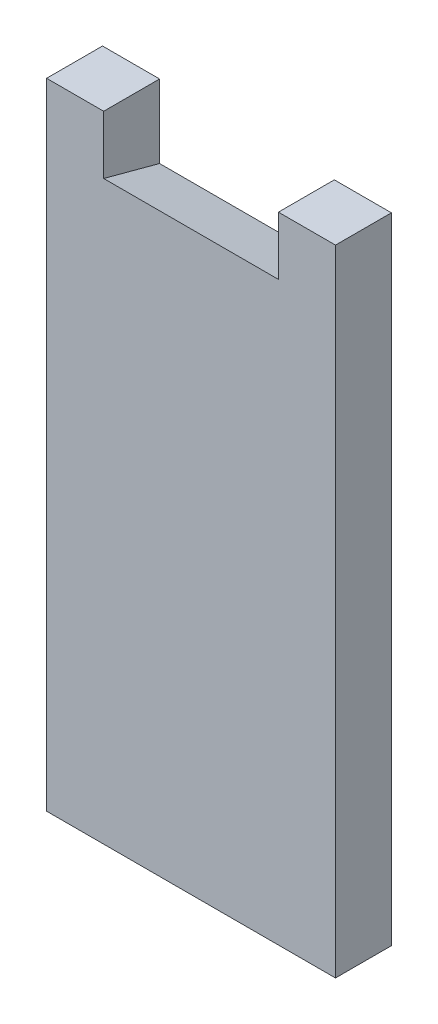
ISO-10303-21;
HEADER;
FILE_DESCRIPTION(('STEP AP214'),'2;1');
FILE_NAME('part.step','',(''),(''),'','','');
FILE_SCHEMA(('AUTOMOTIVE_DESIGN { 1 0 10303 214 1 1 1 1 }'));
ENDSEC;
DATA;
#1=APPLICATION_CONTEXT('core data for automotive mechanical design processes');
#2=APPLICATION_PROTOCOL_DEFINITION('international standard','automotive_design',2000,#1);
#3=PRODUCT_CONTEXT('',#1,'mechanical');
#4=PRODUCT('Part','Part','',(#3));
#5=PRODUCT_RELATED_PRODUCT_CATEGORY('part','',(#4));
#6=PRODUCT_DEFINITION_FORMATION('','',#4);
#7=PRODUCT_DEFINITION_CONTEXT('part definition',#1,'design');
#8=PRODUCT_DEFINITION('design','',#6,#7);
#9=PRODUCT_DEFINITION_SHAPE('','',#8);
#10=(LENGTH_UNIT() NAMED_UNIT(*) SI_UNIT(.MILLI.,.METRE.));
#11=(NAMED_UNIT(*) PLANE_ANGLE_UNIT() SI_UNIT($,.RADIAN.));
#12=(NAMED_UNIT(*) SI_UNIT($,.STERADIAN.) SOLID_ANGLE_UNIT());
#13=UNCERTAINTY_MEASURE_WITH_UNIT(LENGTH_MEASURE(1.E-05),#10,'distance_accuracy_value','');
#14=(GEOMETRIC_REPRESENTATION_CONTEXT(3) GLOBAL_UNCERTAINTY_ASSIGNED_CONTEXT((#13)) GLOBAL_UNIT_ASSIGNED_CONTEXT((#10,
#11,#12)) REPRESENTATION_CONTEXT('',''));
#15=CARTESIAN_POINT('',(0.,0.,0.));
#16=DIRECTION('',(0.,0.,1.));
#17=DIRECTION('',(1.,0.,0.));
#18=AXIS2_PLACEMENT_3D('',#15,#16,#17);
#19=CARTESIAN_POINT('',(0.,0.,9.6));
#20=DIRECTION('',(0.,1.,0.));
#21=DIRECTION('',(0.,0.,1.));
#22=AXIS2_PLACEMENT_3D('',#19,#20,#21);
#23=PLANE('',#22);
#24=DIRECTION('',(1.,0.,0.));
#25=VECTOR('',#24,1.);
#26=CARTESIAN_POINT('',(0.,0.,0.));
#27=LINE('',#26,#25);
#28=CARTESIAN_POINT('',(39.8,0.,0.));
#29=VERTEX_POINT('',#28);
#30=CARTESIAN_POINT('',(49.6,0.,0.));
#31=VERTEX_POINT('',#30);
#32=EDGE_CURVE('E116',#29,#31,#27,.T.);
#33=ORIENTED_EDGE('',*,*,#32,.F.);
#34=DIRECTION('',(0.,0.,-1.));
#35=VECTOR('',#34,1.);
#36=CARTESIAN_POINT('',(39.8,0.,9.6));
#37=LINE('',#36,#35);
#38=CARTESIAN_POINT('',(39.8,0.,9.6));
#39=VERTEX_POINT('',#38);
#40=EDGE_CURVE('E11',#39,#29,#37,.T.);
#41=ORIENTED_EDGE('',*,*,#40,.F.);
#42=DIRECTION('',(1.,0.,0.));
#43=VECTOR('',#42,1.);
#44=CARTESIAN_POINT('',(0.,0.,9.6));
#45=LINE('',#44,#43);
#46=CARTESIAN_POINT('',(49.6,0.,9.6));
#47=VERTEX_POINT('',#46);
#48=EDGE_CURVE('E126',#39,#47,#45,.T.);
#49=ORIENTED_EDGE('',*,*,#48,.T.);
#50=DIRECTION('',(0.,0.,-1.));
#51=VECTOR('',#50,1.);
#52=CARTESIAN_POINT('',(49.6,0.,9.6));
#53=LINE('',#52,#51);
#54=EDGE_CURVE('E57',#47,#31,#53,.T.);
#55=ORIENTED_EDGE('',*,*,#54,.T.);
#56=EDGE_LOOP('',(#33,#41,#49,#55));
#57=FACE_BOUND('',#56,.T.);
#58=ADVANCED_FACE('F38',(#57),#23,.T.);
#59=CARTESIAN_POINT('',(39.8,0.,9.6));
#60=DIRECTION('',(1.,0.,0.));
#61=DIRECTION('',(0.,0.,-1.));
#62=AXIS2_PLACEMENT_3D('',#59,#60,#61);
#63=PLANE('',#62);
#64=DIRECTION('',(0.,-1.,0.));
#65=VECTOR('',#64,1.);
#66=CARTESIAN_POINT('',(39.8,0.,0.));
#67=LINE('',#66,#65);
#68=CARTESIAN_POINT('',(39.8,-12.5723122473388,0.));
#69=VERTEX_POINT('',#68);
#70=EDGE_CURVE('E106',#29,#69,#67,.T.);
#71=ORIENTED_EDGE('',*,*,#70,.T.);
#72=DIRECTION('',(0.,-0.258819045102521,-0.965925826289068));
#73=VECTOR('',#72,1.);
#74=CARTESIAN_POINT('',(39.8,-9.99999999999999,9.6));
#75=LINE('',#74,#73);
#76=CARTESIAN_POINT('',(39.8,-9.99999999999999,9.6));
#77=VERTEX_POINT('',#76);
#78=EDGE_CURVE('E48',#77,#69,#75,.T.);
#79=ORIENTED_EDGE('',*,*,#78,.F.);
#80=DIRECTION('',(0.,-1.,0.));
#81=VECTOR('',#80,1.);
#82=CARTESIAN_POINT('',(39.8,0.,9.6));
#83=LINE('',#82,#81);
#84=EDGE_CURVE('E154',#39,#77,#83,.T.);
#85=ORIENTED_EDGE('',*,*,#84,.F.);
#86=ORIENTED_EDGE('',*,*,#40,.T.);
#87=EDGE_LOOP('',(#71,#79,#85,#86));
#88=FACE_BOUND('',#87,.T.);
#89=ADVANCED_FACE('F163',(#88),#63,.F.);
#90=CARTESIAN_POINT('',(0.,-10.,9.6));
#91=DIRECTION('',(0.,0.965925826289068,-0.258819045102521));
#92=DIRECTION('',(0.,0.258819045102521,0.965925826289068));
#93=AXIS2_PLACEMENT_3D('',#90,#91,#92);
#94=PLANE('',#93);
#95=DIRECTION('',(1.,0.,0.));
#96=VECTOR('',#95,1.);
#97=CARTESIAN_POINT('',(0.,-12.5723122473388,0.));
#98=LINE('',#97,#96);
#99=CARTESIAN_POINT('',(9.79999999999999,-12.5723122473388,0.));
#100=VERTEX_POINT('',#99);
#101=EDGE_CURVE('E103',#100,#69,#98,.T.);
#102=ORIENTED_EDGE('',*,*,#101,.F.);
#103=DIRECTION('',(0.,-0.258819045102521,-0.965925826289068));
#104=VECTOR('',#103,1.);
#105=CARTESIAN_POINT('',(9.79999999999999,-10.,9.6));
#106=LINE('',#105,#104);
#107=CARTESIAN_POINT('',(9.79999999999999,-10.,9.6));
#108=VERTEX_POINT('',#107);
#109=EDGE_CURVE('E42',#108,#100,#106,.T.);
#110=ORIENTED_EDGE('',*,*,#109,.F.);
#111=DIRECTION('',(1.,0.,0.));
#112=VECTOR('',#111,1.);
#113=CARTESIAN_POINT('',(0.,-10.,9.6));
#114=LINE('',#113,#112);
#115=EDGE_CURVE('E150',#108,#77,#114,.T.);
#116=ORIENTED_EDGE('',*,*,#115,.T.);
#117=ORIENTED_EDGE('',*,*,#78,.T.);
#118=EDGE_LOOP('',(#102,#110,#116,#117));
#119=FACE_BOUND('',#118,.T.);
#120=ADVANCED_FACE('F40',(#119),#94,.T.);
#121=CARTESIAN_POINT('',(9.8,0.,9.6));
#122=DIRECTION('',(1.,0.,0.));
#123=DIRECTION('',(0.,1.,0.));
#124=AXIS2_PLACEMENT_3D('',#121,#122,#123);
#125=PLANE('',#124);
#126=DIRECTION('',(0.,-1.,0.));
#127=VECTOR('',#126,1.);
#128=CARTESIAN_POINT('',(9.8,0.,0.));
#129=LINE('',#128,#127);
#130=CARTESIAN_POINT('',(9.8,0.,0.));
#131=VERTEX_POINT('',#130);
#132=EDGE_CURVE('E95',#131,#100,#129,.T.);
#133=ORIENTED_EDGE('',*,*,#132,.F.);
#134=DIRECTION('',(0.,0.,-1.));
#135=VECTOR('',#134,1.);
#136=CARTESIAN_POINT('',(9.8,0.,9.6));
#137=LINE('',#136,#135);
#138=CARTESIAN_POINT('',(9.8,0.,9.6));
#139=VERTEX_POINT('',#138);
#140=EDGE_CURVE('E101',#139,#131,#137,.T.);
#141=ORIENTED_EDGE('',*,*,#140,.F.);
#142=DIRECTION('',(0.,-1.,0.));
#143=VECTOR('',#142,1.);
#144=CARTESIAN_POINT('',(9.8,0.,9.6));
#145=LINE('',#144,#143);
#146=EDGE_CURVE('E99',#139,#108,#145,.T.);
#147=ORIENTED_EDGE('',*,*,#146,.T.);
#148=ORIENTED_EDGE('',*,*,#109,.T.);
#149=EDGE_LOOP('',(#133,#141,#147,#148));
#150=FACE_BOUND('',#149,.T.);
#151=ADVANCED_FACE('F92',(#150),#125,.T.);
#152=CARTESIAN_POINT('',(0.,0.,0.));
#153=VERTEX_POINT('',#152);
#154=EDGE_CURVE('E112',#153,#131,#27,.T.);
#155=ORIENTED_EDGE('',*,*,#154,.F.);
#156=DIRECTION('',(0.,0.,-1.));
#157=VECTOR('',#156,1.);
#158=CARTESIAN_POINT('',(0.,0.,9.6));
#159=LINE('',#158,#157);
#160=CARTESIAN_POINT('',(0.,0.,9.6));
#161=VERTEX_POINT('',#160);
#162=EDGE_CURVE('E134',#161,#153,#159,.T.);
#163=ORIENTED_EDGE('',*,*,#162,.F.);
#164=EDGE_CURVE('E142',#161,#139,#45,.T.);
#165=ORIENTED_EDGE('',*,*,#164,.T.);
#166=ORIENTED_EDGE('',*,*,#140,.T.);
#167=EDGE_LOOP('',(#155,#163,#165,#166));
#168=FACE_BOUND('',#167,.T.);
#169=ADVANCED_FACE('F138',(#168),#23,.T.);
#170=CARTESIAN_POINT('',(0.,0.,9.6));
#171=DIRECTION('',(1.,0.,0.));
#172=DIRECTION('',(0.,1.,0.));
#173=AXIS2_PLACEMENT_3D('',#170,#171,#172);
#174=PLANE('',#173);
#175=DIRECTION('',(0.,-1.,0.));
#176=VECTOR('',#175,1.);
#177=CARTESIAN_POINT('',(0.,0.,0.));
#178=LINE('',#177,#176);
#179=CARTESIAN_POINT('',(0.,-108.97,0.));
#180=VERTEX_POINT('',#179);
#181=EDGE_CURVE('E114',#153,#180,#178,.T.);
#182=ORIENTED_EDGE('',*,*,#181,.T.);
#183=DIRECTION('',(0.,0.,-1.));
#184=VECTOR('',#183,1.);
#185=CARTESIAN_POINT('',(0.,-108.97,9.6));
#186=LINE('',#185,#184);
#187=CARTESIAN_POINT('',(0.,-108.97,9.6));
#188=VERTEX_POINT('',#187);
#189=EDGE_CURVE('E131',#188,#180,#186,.T.);
#190=ORIENTED_EDGE('',*,*,#189,.F.);
#191=DIRECTION('',(0.,-1.,0.));
#192=VECTOR('',#191,1.);
#193=CARTESIAN_POINT('',(0.,0.,9.6));
#194=LINE('',#193,#192);
#195=EDGE_CURVE('E152',#161,#188,#194,.T.);
#196=ORIENTED_EDGE('',*,*,#195,.F.);
#197=ORIENTED_EDGE('',*,*,#162,.T.);
#198=EDGE_LOOP('',(#182,#190,#196,#197));
#199=FACE_BOUND('',#198,.T.);
#200=ADVANCED_FACE('F177',(#199),#174,.F.);
#201=CARTESIAN_POINT('',(0.,-108.97,9.6));
#202=DIRECTION('',(0.,1.,0.));
#203=DIRECTION('',(0.,0.,1.));
#204=AXIS2_PLACEMENT_3D('',#201,#202,#203);
#205=PLANE('',#204);
#206=DIRECTION('',(1.,0.,0.));
#207=VECTOR('',#206,1.);
#208=CARTESIAN_POINT('',(0.,-108.97,0.));
#209=LINE('',#208,#207);
#210=CARTESIAN_POINT('',(49.6,-108.97,0.));
#211=VERTEX_POINT('',#210);
#212=EDGE_CURVE('E120',#180,#211,#209,.T.);
#213=ORIENTED_EDGE('',*,*,#212,.T.);
#214=DIRECTION('',(0.,0.,-1.));
#215=VECTOR('',#214,1.);
#216=CARTESIAN_POINT('',(49.6,-108.97,9.6));
#217=LINE('',#216,#215);
#218=CARTESIAN_POINT('',(49.6,-108.97,9.6));
#219=VERTEX_POINT('',#218);
#220=EDGE_CURVE('E128',#219,#211,#217,.T.);
#221=ORIENTED_EDGE('',*,*,#220,.F.);
#222=DIRECTION('',(1.,0.,0.));
#223=VECTOR('',#222,1.);
#224=CARTESIAN_POINT('',(0.,-108.97,9.6));
#225=LINE('',#224,#223);
#226=EDGE_CURVE('E159',#188,#219,#225,.T.);
#227=ORIENTED_EDGE('',*,*,#226,.F.);
#228=ORIENTED_EDGE('',*,*,#189,.T.);
#229=EDGE_LOOP('',(#213,#221,#227,#228));
#230=FACE_BOUND('',#229,.T.);
#231=ADVANCED_FACE('F174',(#230),#205,.F.);
#232=CARTESIAN_POINT('',(49.6,0.,9.6));
#233=DIRECTION('',(1.,0.,0.));
#234=DIRECTION('',(0.,1.,0.));
#235=AXIS2_PLACEMENT_3D('',#232,#233,#234);
#236=PLANE('',#235);
#237=DIRECTION('',(0.,-1.,0.));
#238=VECTOR('',#237,1.);
#239=CARTESIAN_POINT('',(49.6,0.,0.));
#240=LINE('',#239,#238);
#241=EDGE_CURVE('E123',#31,#211,#240,.T.);
#242=ORIENTED_EDGE('',*,*,#241,.F.);
#243=ORIENTED_EDGE('',*,*,#54,.F.);
#244=DIRECTION('',(0.,-1.,0.));
#245=VECTOR('',#244,1.);
#246=CARTESIAN_POINT('',(49.6,0.,9.6));
#247=LINE('',#246,#245);
#248=EDGE_CURVE('E129',#47,#219,#247,.T.);
#249=ORIENTED_EDGE('',*,*,#248,.T.);
#250=ORIENTED_EDGE('',*,*,#220,.T.);
#251=EDGE_LOOP('',(#242,#243,#249,#250));
#252=FACE_BOUND('',#251,.T.);
#253=ADVANCED_FACE('F171',(#252),#236,.T.);
#254=CARTESIAN_POINT('',(0.,0.,9.6));
#255=DIRECTION('',(0.,0.,1.));
#256=DIRECTION('',(1.,0.,0.));
#257=AXIS2_PLACEMENT_3D('',#254,#255,#256);
#258=PLANE('',#257);
#259=ORIENTED_EDGE('',*,*,#48,.F.);
#260=ORIENTED_EDGE('',*,*,#84,.T.);
#261=ORIENTED_EDGE('',*,*,#115,.F.);
#262=ORIENTED_EDGE('',*,*,#146,.F.);
#263=ORIENTED_EDGE('',*,*,#164,.F.);
#264=ORIENTED_EDGE('',*,*,#195,.T.);
#265=ORIENTED_EDGE('',*,*,#226,.T.);
#266=ORIENTED_EDGE('',*,*,#248,.F.);
#267=EDGE_LOOP('',(#259,#260,#261,#262,#263,#264,#265,#266));
#268=FACE_BOUND('',#267,.T.);
#269=ADVANCED_FACE('F147',(#268),#258,.T.);
#270=CARTESIAN_POINT('',(0.,0.,0.));
#271=DIRECTION('',(0.,0.,1.));
#272=DIRECTION('',(1.,0.,0.));
#273=AXIS2_PLACEMENT_3D('',#270,#271,#272);
#274=PLANE('',#273);
#275=ORIENTED_EDGE('',*,*,#32,.T.);
#276=ORIENTED_EDGE('',*,*,#241,.T.);
#277=ORIENTED_EDGE('',*,*,#212,.F.);
#278=ORIENTED_EDGE('',*,*,#181,.F.);
#279=ORIENTED_EDGE('',*,*,#154,.T.);
#280=ORIENTED_EDGE('',*,*,#132,.T.);
#281=ORIENTED_EDGE('',*,*,#101,.T.);
#282=ORIENTED_EDGE('',*,*,#70,.F.);
#283=EDGE_LOOP('',(#275,#276,#277,#278,#279,#280,#281,#282));
#284=FACE_BOUND('',#283,.T.);
#285=ADVANCED_FACE('F109',(#284),#274,.F.);
#286=CLOSED_SHELL('',(#58,#89,#120,#151,#169,#200,#231,#253,#269,#285));
#287=MANIFOLD_SOLID_BREP('B2',#286);
#288=ADVANCED_BREP_SHAPE_REPRESENTATION('',(#18,#287),#14);
#289=SHAPE_DEFINITION_REPRESENTATION(#9,#288);
ENDSEC;
END-ISO-10303-21;
